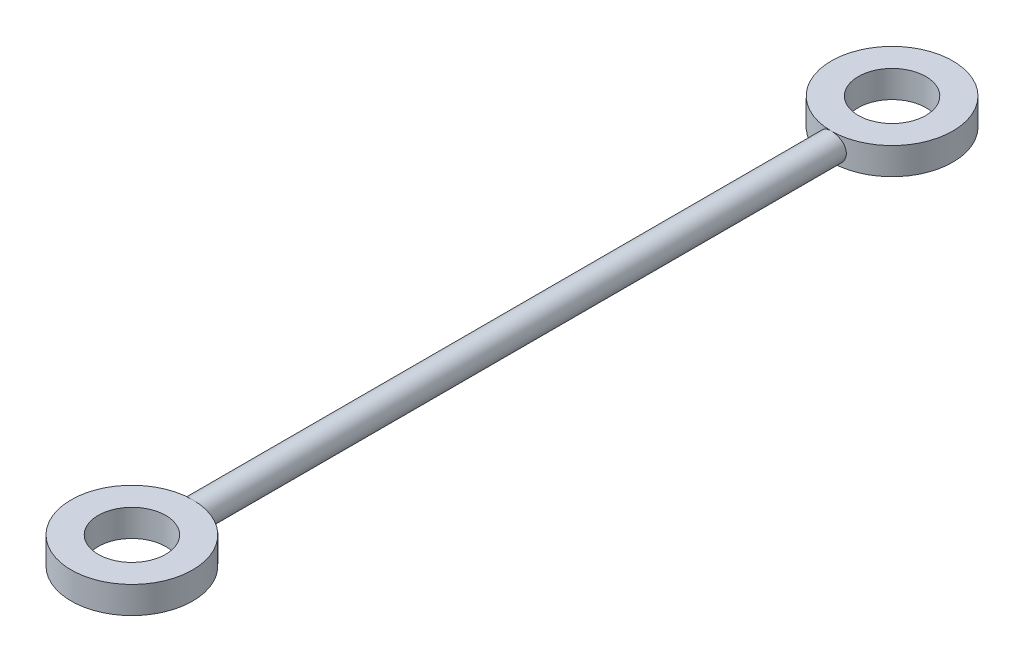
ISO-10303-21;
HEADER;
FILE_DESCRIPTION(('STEP AP214'),'2;1');
FILE_NAME('part.step','',(''),(''),'','','');
FILE_SCHEMA(('AUTOMOTIVE_DESIGN { 1 0 10303 214 1 1 1 1 }'));
ENDSEC;
DATA;
#1=APPLICATION_CONTEXT('core data for automotive mechanical design processes');
#2=APPLICATION_PROTOCOL_DEFINITION('international standard','automotive_design',2000,#1);
#3=PRODUCT_CONTEXT('',#1,'mechanical');
#4=PRODUCT('Part','Part','',(#3));
#5=PRODUCT_RELATED_PRODUCT_CATEGORY('part','',(#4));
#6=PRODUCT_DEFINITION_FORMATION('','',#4);
#7=PRODUCT_DEFINITION_CONTEXT('part definition',#1,'design');
#8=PRODUCT_DEFINITION('design','',#6,#7);
#9=PRODUCT_DEFINITION_SHAPE('','',#8);
#10=(LENGTH_UNIT() NAMED_UNIT(*) SI_UNIT(.MILLI.,.METRE.));
#11=(NAMED_UNIT(*) PLANE_ANGLE_UNIT() SI_UNIT($,.RADIAN.));
#12=(NAMED_UNIT(*) SI_UNIT($,.STERADIAN.) SOLID_ANGLE_UNIT());
#13=UNCERTAINTY_MEASURE_WITH_UNIT(LENGTH_MEASURE(1.E-05),#10,'distance_accuracy_value','');
#14=(GEOMETRIC_REPRESENTATION_CONTEXT(3) GLOBAL_UNCERTAINTY_ASSIGNED_CONTEXT((#13)) GLOBAL_UNIT_ASSIGNED_CONTEXT((#10,
#11,#12)) REPRESENTATION_CONTEXT('',''));
#15=CARTESIAN_POINT('',(0.,0.,0.));
#16=DIRECTION('',(0.,0.,1.));
#17=DIRECTION('',(1.,0.,0.));
#18=AXIS2_PLACEMENT_3D('',#15,#16,#17);
#19=CARTESIAN_POINT('',(0.,0.,493.));
#20=DIRECTION('',(0.,0.,-1.));
#21=DIRECTION('',(-1.,0.,0.));
#22=AXIS2_PLACEMENT_3D('',#19,#20,#21);
#23=CYLINDRICAL_SURFACE('',#22,10.);
#24=CARTESIAN_POINT('',(-10.,0.,484.125178063039));
#25=CARTESIAN_POINT('',(-10.0000066355174,0.277197442532807,484.125182060645));
#26=CARTESIAN_POINT('',(-9.98847171475353,0.554316796202622,484.12254640704));
#27=CARTESIAN_POINT('',(-9.94244080091867,1.10662458692624,484.112091824683));
#28=CARTESIAN_POINT('',(-9.90794144345641,1.38181273507938,484.104272136449));
#29=CARTESIAN_POINT('',(-9.81622730662358,1.92834846536891,484.083671931044));
#30=CARTESIAN_POINT('',(-9.75899865983989,2.19969359797047,484.07088838547));
#31=CARTESIAN_POINT('',(-9.6222897000386,2.73646498042402,484.040741157838));
#32=CARTESIAN_POINT('',(-9.54280889358356,3.00189109888207,484.023377374215));
#33=CARTESIAN_POINT('',(-9.36232363211918,3.52466728040577,483.984600463437));
#34=CARTESIAN_POINT('',(-9.26134411393705,3.78202630725405,483.963192030971));
#35=CARTESIAN_POINT('',(-9.03856882202602,4.28724791885802,483.916928336009));
#36=CARTESIAN_POINT('',(-8.91677289202699,4.53511043230566,483.892073047636));
#37=CARTESIAN_POINT('',(-8.65327610991877,5.01964639725508,483.839623591996));
#38=CARTESIAN_POINT('',(-8.51157928532596,5.2563220998074,483.812029979238));
#39=CARTESIAN_POINT('',(-8.20920291384275,5.71707494293494,483.75485720294));
#40=CARTESIAN_POINT('',(-8.04851710517191,5.94114789149128,483.725277385829));
#41=CARTESIAN_POINT('',(-7.70665196761771,6.37853821202931,483.664482493137));
#42=CARTESIAN_POINT('',(-7.52519346875172,6.59163489616678,483.633249171804));
#43=CARTESIAN_POINT('',(-7.14508742414899,7.00185098948534,483.570451026165));
#44=CARTESIAN_POINT('',(-6.94643973376854,7.19897026419261,483.538886199069));
#45=CARTESIAN_POINT('',(-6.533227228317,7.57596048338589,483.476291619297));
#46=CARTESIAN_POINT('',(-6.31865836807533,7.7558270175847,483.44526200509));
#47=CARTESIAN_POINT('',(-5.87514943275329,8.09696615352433,483.384613786561));
#48=CARTESIAN_POINT('',(-5.64621442322683,8.25824525299123,483.354994691295));
#49=CARTESIAN_POINT('',(-5.17281633078056,8.56283030998386,483.29765738967));
#50=CARTESIAN_POINT('',(-4.92820929930194,8.7059173191924,483.269963882132));
#51=CARTESIAN_POINT('',(-4.4274736123192,8.97093752710851,483.217628054754));
#52=CARTESIAN_POINT('',(-4.17134484741106,9.09287052489587,483.192985763894));
#53=CARTESIAN_POINT('',(-3.64939077987307,9.3146305073054,483.147457610355));
#54=CARTESIAN_POINT('',(-3.38356634803353,9.41445947147582,483.126571411326));
#55=CARTESIAN_POINT('',(-2.84411354338911,9.59122397243424,483.089153778601));
#56=CARTESIAN_POINT('',(-2.57048531244741,9.66815992509783,483.072622265799));
#57=CARTESIAN_POINT('',(-2.0219059450153,9.79744984081775,483.044620975403));
#58=CARTESIAN_POINT('',(-1.74704760529242,9.85018087432109,483.033073734313));
#59=CARTESIAN_POINT('',(-1.19371647833373,9.93243539867256,483.014984059837));
#60=CARTESIAN_POINT('',(-0.915243726257882,9.96195911510308,483.008441577804));
#61=CARTESIAN_POINT('',(-0.356758613685382,9.99755014860303,483.00054770417));
#62=CARTESIAN_POINT('',(-0.0767464148417817,10.0036198831168,482.99919577757));
#63=CARTESIAN_POINT('',(0.482775600467452,9.99225819963959,483.00172011431));
#64=CARTESIAN_POINT('',(0.762285421778734,9.97482700955647,483.005596326948));
#65=CARTESIAN_POINT('',(1.31384294910447,9.9171240024544,483.018352889529));
#66=CARTESIAN_POINT('',(1.58593543344871,9.87725932241897,483.027144022406));
#67=CARTESIAN_POINT('',(2.12572525714352,9.77531239015691,483.049424243046));
#68=CARTESIAN_POINT('',(2.39342265664285,9.71323044224934,483.062913266462));
#69=CARTESIAN_POINT('',(2.92252601527151,9.56734760197829,483.094220073175));
#70=CARTESIAN_POINT('',(3.18393292068278,9.48354999891512,483.112037200863));
#71=CARTESIAN_POINT('',(3.69881570289267,9.29483575163701,483.151527771881));
#72=CARTESIAN_POINT('',(3.95228858085104,9.18991123080244,483.173202653123));
#73=CARTESIAN_POINT('',(4.45132952902083,8.95889607614719,483.21999399981));
#74=CARTESIAN_POINT('',(4.69682645024667,8.83265662888045,483.245134416615));
#75=CARTESIAN_POINT('',(5.17634390438709,8.5604600311286,483.298057529706));
#76=CARTESIAN_POINT('',(5.41036398315088,8.41450210121898,483.325840330427));
#77=CARTESIAN_POINT('',(5.86542059030689,8.10387197900684,483.383305253708));
#78=CARTESIAN_POINT('',(6.08645582299911,7.93919792390072,483.412987565196));
#79=CARTESIAN_POINT('',(6.51409742411986,7.59225589944118,483.473455341241));
#80=CARTESIAN_POINT('',(6.72070358742227,7.40998768005382,483.50424082147));
#81=CARTESIAN_POINT('',(7.12243480841223,7.02495444933247,483.566756381913));
#82=CARTESIAN_POINT('',(7.31721740168041,6.82183293776882,483.598492538258));
#83=CARTESIAN_POINT('',(7.6890150554252,6.39985331789804,483.661364417843));
#84=CARTESIAN_POINT('',(7.8660304215152,6.18099548038201,483.692500151402));
#85=CARTESIAN_POINT('',(8.20111653213186,5.7289494722103,483.753297300597));
#86=CARTESIAN_POINT('',(8.35918269845478,5.49575785895996,483.782958358935));
#87=CARTESIAN_POINT('',(8.65513773025569,5.01675375156801,483.839935440696));
#88=CARTESIAN_POINT('',(8.79303430654859,4.77094612932034,483.867252358622));
#89=CARTESIAN_POINT('',(9.04813261249284,4.26745880992954,483.918844183761));
#90=CARTESIAN_POINT('',(9.16526331319349,4.0097420272449,483.943108570751));
#91=CARTESIAN_POINT('',(9.37735432866314,3.4850115369423,483.987763291236));
#92=CARTESIAN_POINT('',(9.47231454266676,3.21799778707574,484.008153607124));
#93=CARTESIAN_POINT('',(9.6392890067375,2.67662771181626,484.044438189063));
#94=CARTESIAN_POINT('',(9.7113063454228,2.40227238015765,484.060333060267));
#95=CARTESIAN_POINT('',(9.83181147093619,1.84820359508206,484.087139679447));
#96=CARTESIAN_POINT('',(9.88029973496401,1.56849025045205,484.098051528482));
#97=CARTESIAN_POINT('',(9.95256530014125,1.01172291908329,484.114378365281));
#98=CARTESIAN_POINT('',(9.97684100544706,0.734736783457172,484.119904165499));
#99=CARTESIAN_POINT('',(10.0022454063079,0.179651619634437,484.125687932935));
#100=CARTESIAN_POINT('',(10.0033744247638,-0.0984473929831904,484.12594597364));
#101=CARTESIAN_POINT('',(9.98247709090377,-0.65370896964737,484.121186613415));
#102=CARTESIAN_POINT('',(9.96045227188063,-0.930871594484082,484.116169561813));
#103=CARTESIAN_POINT('',(9.89343360462578,-1.4822623849427,484.10101198488));
#104=CARTESIAN_POINT('',(9.84843982491226,-1.7564905593158,484.090871474832));
#105=CARTESIAN_POINT('',(9.73654828490245,-2.29668749663247,484.065925934119));
#106=CARTESIAN_POINT('',(9.66992730038299,-2.5627163983516,484.051179928606));
#107=CARTESIAN_POINT('',(9.51516232615793,-3.08815397899649,484.017413076944));
#108=CARTESIAN_POINT('',(9.42701856456304,-3.34756272805424,483.998392276103));
#109=CARTESIAN_POINT('',(9.22988482846472,-3.85798761759896,483.956619474791));
#110=CARTESIAN_POINT('',(9.12089710368716,-4.10900466038585,483.933867877029));
#111=CARTESIAN_POINT('',(8.88281832727282,-4.6011176518281,483.88525987347));
#112=CARTESIAN_POINT('',(8.75371963051583,-4.84220978331397,483.859402287801));
#113=CARTESIAN_POINT('',(8.47421043922678,-5.31645367518366,483.804883360639));
#114=CARTESIAN_POINT('',(8.32350174323971,-5.54942542925457,483.776184902282));
#115=CARTESIAN_POINT('',(8.00329673185376,-6.00200961456149,483.717116754865));
#116=CARTESIAN_POINT('',(7.83379193643558,-6.22161594610396,483.686746314612));
#117=CARTESIAN_POINT('',(7.47717447959211,-6.64595209949791,483.625180600558));
#118=CARTESIAN_POINT('',(7.29005981359174,-6.85068022301404,483.593985233145));
#119=CARTESIAN_POINT('',(6.89956213124844,-7.24380909287628,483.531639218675));
#120=CARTESIAN_POINT('',(6.69618625448154,-7.43221692985689,483.500488558041));
#121=CARTESIAN_POINT('',(6.27024921924229,-7.79511313541661,483.438456157857));
#122=CARTESIAN_POINT('',(6.04738845010294,-7.96925304493631,483.407591884327));
#123=CARTESIAN_POINT('',(5.58764622676977,-8.29807519539926,483.347654947291));
#124=CARTESIAN_POINT('',(5.35077002981555,-8.45276466508074,483.318581620243));
#125=CARTESIAN_POINT('',(4.86449494214552,-8.74166354742357,483.263028986792));
#126=CARTESIAN_POINT('',(4.61509400819286,-8.8758696039818,483.236550105731));
#127=CARTESIAN_POINT('',(4.10553622657001,-9.1227583522989,483.186942883172));
#128=CARTESIAN_POINT('',(3.84537950997421,-9.23544130625316,483.16381450086));
#129=CARTESIAN_POINT('',(3.31788423375226,-9.43773881903109,483.121706981733));
#130=CARTESIAN_POINT('',(3.05060386047587,-9.52749960864282,483.102701665471));
#131=CARTESIAN_POINT('',(2.5091540113753,-9.68419194640782,483.069189747035));
#132=CARTESIAN_POINT('',(2.2349845506361,-9.75112354454529,483.054683135012));
#133=CARTESIAN_POINT('',(1.68179439258039,-9.8615979063935,483.030585909788));
#134=CARTESIAN_POINT('',(1.40277430900402,-9.90514360715957,483.020994679268));
#135=CARTESIAN_POINT('',(0.841923873246669,-9.9684904357305,483.007002286061));
#136=CARTESIAN_POINT('',(0.560093568443582,-9.98829196316142,483.002601036025));
#137=CARTESIAN_POINT('',(0.00179755325416161,-10.0038143518799,482.999152788285));
#138=CARTESIAN_POINT('',(-0.274653474233067,-10.000042917947,482.999992903477));
#139=CARTESIAN_POINT('',(-0.826229659015594,-9.9696355052774,483.006740368801));
#140=CARTESIAN_POINT('',(-1.10135483651436,-9.94299987606321,483.012647641473));
#141=CARTESIAN_POINT('',(-1.64830268540822,-9.86708299888812,483.029365589568));
#142=CARTESIAN_POINT('',(-1.92012543716311,-9.81780230309981,483.040176145431));
#143=CARTESIAN_POINT('',(-2.45855285100677,-9.69699148132744,483.066402646736));
#144=CARTESIAN_POINT('',(-2.7251574910218,-9.62546126124464,483.081818611656));
#145=CARTESIAN_POINT('',(-3.2503372803598,-9.46101204377771,483.116770134999));
#146=CARTESIAN_POINT('',(-3.50893806699979,-9.36817164202437,483.136290533879));
#147=CARTESIAN_POINT('',(-4.01746316200564,-9.16162286711694,483.178965587602));
#148=CARTESIAN_POINT('',(-4.2673842819051,-9.04790691979081,483.202121561079));
#149=CARTESIAN_POINT('',(-4.75676892894314,-8.80047280579502,483.251439878226));
#150=CARTESIAN_POINT('',(-4.99623372160148,-8.666757068399,483.277601856681));
#151=CARTESIAN_POINT('',(-5.46319502588091,-8.38024707534127,483.332240126449));
#152=CARTESIAN_POINT('',(-5.6906910352325,-8.22745201992299,483.360716514757));
#153=CARTESIAN_POINT('',(-6.13656537636527,-7.90066114468177,483.419801168216));
#154=CARTESIAN_POINT('',(-6.35467908683693,-7.72630973821802,483.450440195041));
#155=CARTESIAN_POINT('',(-6.77550910055343,-7.36004695131374,483.512499216879));
#156=CARTESIAN_POINT('',(-6.97822521891473,-7.16813536008375,483.543919221264));
#157=CARTESIAN_POINT('',(-7.36696631526038,-6.767986046255,483.606683032564));
#158=CARTESIAN_POINT('',(-7.55298714300411,-6.55974428815461,483.638026818658));
#159=CARTESIAN_POINT('',(-7.90702754703794,-6.12835824073688,483.699760566317));
#160=CARTESIAN_POINT('',(-8.07504750769643,-5.90521426978833,483.730150548238));
#161=CARTESIAN_POINT('',(-8.39417795554417,-5.44223601949818,483.789543065749));
#162=CARTESIAN_POINT('',(-8.54501578914354,-5.2022103737809,483.818519910858));
#163=CARTESIAN_POINT('',(-8.82583821470053,-4.71007650581806,483.873759978258));
#164=CARTESIAN_POINT('',(-8.9558304617533,-4.45797276336975,483.900024195437));
#165=CARTESIAN_POINT('',(-9.19397978092942,-3.94347878991424,483.949057555605));
#166=CARTESIAN_POINT('',(-9.3021486667316,-3.68109421661574,483.971828587958));
#167=CARTESIAN_POINT('',(-9.49586125307177,-3.14787518141745,484.013202099574));
#168=CARTESIAN_POINT('',(-9.58140894978562,-2.87704222144189,484.031805315019));
#169=CARTESIAN_POINT('',(-9.76938744890762,-2.17967135398237,484.073094877285));
#170=CARTESIAN_POINT('',(-9.85573543951876,-1.74848909006035,484.092507566439));
#171=CARTESIAN_POINT('',(-9.97103497070132,-0.878138996188523,484.118545661969));
#172=CARTESIAN_POINT('',(-9.99998949195373,-0.438971582136196,484.125171732406));
#173=CARTESIAN_POINT('',(-10.,0.,484.125178063039));
#174=B_SPLINE_CURVE_WITH_KNOTS('',3,(#24,#25,#26,#27,#28,#29,#30,#31,#32,#33,#34,#35,#36,#37,
#38,#39,#40,#41,#42,#43,#44,#45,#46,#47,#48,#49,#50,#51,#52,#53,#54,#55,#56,#57,#58,#59,#60,#61,
#62,#63,#64,#65,#66,#67,#68,#69,#70,#71,#72,#73,#74,#75,#76,#77,#78,#79,#80,#81,#82,#83,#84,#85,
#86,#87,#88,#89,#90,#91,#92,#93,#94,#95,#96,#97,#98,#99,#100,#101,#102,#103,#104,#105,#106,#107,
#108,#109,#110,#111,#112,#113,#114,#115,#116,#117,#118,#119,#120,#121,#122,#123,#124,#125,#126,
#127,#128,#129,#130,#131,#132,#133,#134,#135,#136,#137,#138,#139,#140,#141,#142,#143,#144,#145,
#146,#147,#148,#149,#150,#151,#152,#153,#154,#155,#156,#157,#158,#159,#160,#161,#162,#163,#164,
#165,#166,#167,#168,#169,#170,#171,#172,#173),.UNSPECIFIED.,.T.,.F.,(4,2,2,2,2,2,2,2,2,2,2,2,2,
2,2,2,2,2,2,2,2,2,2,2,2,2,2,2,2,2,2,2,2,2,2,2,2,2,2,2,2,2,2,2,2,2,2,2,2,2,2,2,2,2,2,2,2,2,2,2,2,
2,2,2,2,2,2,2,2,2,2,2,2,2,4),(0.,0.831205676531437,1.6625331551697,2.49436861778412,
3.32622252765402,4.15711675820889,4.9880172266141,5.81874978015648,6.64975704334213,
7.49365162594608,8.3375533104498,9.18167014830853,10.0254910021185,10.8786616357507,
11.7318403723304,12.584942670726,13.4380294706759,14.2773335932149,15.1166295573542,
15.9558390114323,16.7950403270612,17.6194809143563,18.4439102093818,19.2682146998802,
20.0928270817181,20.9234546086684,21.754114977952,22.5848580948334,23.4156130192982,
24.2642339450799,25.112840271264,25.9616512127427,26.8101368016697,27.66147084824,
28.5128087640683,29.3640320225156,30.2152380163456,31.0485364998869,31.8818233587396,
32.7150550391679,33.5482842340159,34.3712448056457,35.1941966554467,36.0170597326723,
36.8402363854004,37.6761192557802,38.5123807880236,39.348737629389,40.1847292589989,
41.0372340215198,41.8894210090214,42.7417474734854,43.5940635542083,44.4407982600892,
45.2875311120447,46.1341575971965,46.9807698330103,47.8092118418964,48.6376411867061,
49.4660503323384,50.2944629815653,51.1198680458264,51.9455731817979,52.771178104857,
53.5968176468029,54.4385718995447,55.2803362578868,56.1223092920759,56.9642643442224,
57.8181230778923,58.671667528595,59.5247486814391,60.3776790312803,61.6940498410606,
63.0103522844513),.UNSPECIFIED.);
#175=CARTESIAN_POINT('',(0.,-10.,483.));
#176=VERTEX_POINT('',#175);
#177=CARTESIAN_POINT('',(0.,10.,483.));
#178=VERTEX_POINT('',#177);
#179=EDGE_CURVE('E69',#176,#178,#174,.T.);
#180=ORIENTED_EDGE('',*,*,#179,.T.);
#181=EDGE_CURVE('E67',#178,#176,#174,.T.);
#182=ORIENTED_EDGE('',*,*,#181,.T.);
#183=EDGE_LOOP('',(#180,#182));
#184=FACE_BOUND('',#183,.T.);
#185=CARTESIAN_POINT('',(-10.,0.,8.87482193696059));
#186=CARTESIAN_POINT('',(-10.0000066355174,0.277197442532807,8.87481793935492));
#187=CARTESIAN_POINT('',(-9.98847171475353,0.554316796202622,8.87745359296051));
#188=CARTESIAN_POINT('',(-9.94244080091867,1.10662458692624,8.88790817531715));
#189=CARTESIAN_POINT('',(-9.90794144345641,1.38181273507938,8.89572786355144));
#190=CARTESIAN_POINT('',(-9.81622730662358,1.92834846536891,8.91632806895643));
#191=CARTESIAN_POINT('',(-9.75899865983989,2.19969359797046,8.92911161452978));
#192=CARTESIAN_POINT('',(-9.6222897000386,2.73646498042402,8.95925884216154));
#193=CARTESIAN_POINT('',(-9.54280889358356,3.00189109888207,8.97662262578536));
#194=CARTESIAN_POINT('',(-9.36232363211918,3.52466728040577,9.01539953656343));
#195=CARTESIAN_POINT('',(-9.26134411393705,3.78202630725405,9.03680796902857));
#196=CARTESIAN_POINT('',(-9.03856882202602,4.28724791885802,9.0830716639913));
#197=CARTESIAN_POINT('',(-8.91677289202699,4.53511043230566,9.10792695236439));
#198=CARTESIAN_POINT('',(-8.65327610991877,5.01964639725509,9.16037640800452));
#199=CARTESIAN_POINT('',(-8.51157928532595,5.2563220998074,9.18797002076242));
#200=CARTESIAN_POINT('',(-8.20920291384274,5.71707494293494,9.2451427970597));
#201=CARTESIAN_POINT('',(-8.04851710517191,5.94114789149128,9.27472261417078));
#202=CARTESIAN_POINT('',(-7.70665196761771,6.3785382120293,9.33551750686349));
#203=CARTESIAN_POINT('',(-7.52519346875172,6.59163489616677,9.3667508281955));
#204=CARTESIAN_POINT('',(-7.14508742414899,7.00185098948534,9.42954897383532));
#205=CARTESIAN_POINT('',(-6.94643973376854,7.19897026419261,9.46111380093072));
#206=CARTESIAN_POINT('',(-6.533227228317,7.57596048338589,9.52370838070293));
#207=CARTESIAN_POINT('',(-6.31865836807533,7.7558270175847,9.55473799491041));
#208=CARTESIAN_POINT('',(-5.87514943275329,8.09696615352433,9.61538621343851));
#209=CARTESIAN_POINT('',(-5.64621442322683,8.25824525299123,9.64500530870539));
#210=CARTESIAN_POINT('',(-5.17281633078056,8.56283030998386,9.70234261033026));
#211=CARTESIAN_POINT('',(-4.92820929930194,8.7059173191924,9.73003611786768));
#212=CARTESIAN_POINT('',(-4.42747361231919,8.97093752710852,9.78237194524591));
#213=CARTESIAN_POINT('',(-4.17134484741105,9.09287052489587,9.80701423610572));
#214=CARTESIAN_POINT('',(-3.64939077987306,9.3146305073054,9.85254238964527));
#215=CARTESIAN_POINT('',(-3.38356634803352,9.41445947147582,9.87342858867398));
#216=CARTESIAN_POINT('',(-2.84411354338911,9.59122397243423,9.91084622139857));
#217=CARTESIAN_POINT('',(-2.57048531244741,9.66815992509783,9.92737773420128));
#218=CARTESIAN_POINT('',(-2.0219059450153,9.79744984081775,9.95537902459655));
#219=CARTESIAN_POINT('',(-1.74704760529242,9.85018087432109,9.96692626568725));
#220=CARTESIAN_POINT('',(-1.19371647833373,9.93243539867256,9.9850159401631));
#221=CARTESIAN_POINT('',(-0.915243726257882,9.96195911510308,9.99155842219606));
#222=CARTESIAN_POINT('',(-0.356758613685381,9.99755014860303,9.99945229582951));
#223=CARTESIAN_POINT('',(-0.0767464148417808,10.0036198831168,10.0008042224299));
#224=CARTESIAN_POINT('',(0.482775600467452,9.99225819963959,9.99827988569021));
#225=CARTESIAN_POINT('',(0.762285421778733,9.97482700955647,9.9944036730518));
#226=CARTESIAN_POINT('',(1.31384294910447,9.9171240024544,9.98164711047053));
#227=CARTESIAN_POINT('',(1.5859354334487,9.87725932241898,9.97285597759435));
#228=CARTESIAN_POINT('',(2.12572525714351,9.77531239015692,9.95057575695372));
#229=CARTESIAN_POINT('',(2.39342265664284,9.71323044224934,9.93708673353827));
#230=CARTESIAN_POINT('',(2.9225260152715,9.56734760197829,9.90577992682529));
#231=CARTESIAN_POINT('',(3.18393292068278,9.48354999891512,9.88796279913726));
#232=CARTESIAN_POINT('',(3.69881570289267,9.29483575163702,9.84847222811891));
#233=CARTESIAN_POINT('',(3.95228858085104,9.18991123080245,9.82679734687676));
#234=CARTESIAN_POINT('',(4.45132952902083,8.95889607614719,9.78000600018973));
#235=CARTESIAN_POINT('',(4.69682645024667,8.83265662888045,9.75486558338522));
#236=CARTESIAN_POINT('',(5.17634390438709,8.5604600311286,9.70194247029399));
#237=CARTESIAN_POINT('',(5.41036398315087,8.41450210121898,9.674159669573));
#238=CARTESIAN_POINT('',(5.86542059030688,8.10387197900684,9.61669474629211));
#239=CARTESIAN_POINT('',(6.08645582299911,7.93919792390072,9.58701243480384));
#240=CARTESIAN_POINT('',(6.51409742411986,7.59225589944118,9.52654465875931));
#241=CARTESIAN_POINT('',(6.72070358742227,7.40998768005382,9.49575917852962));
#242=CARTESIAN_POINT('',(7.12243480841223,7.02495444933247,9.43324361808737));
#243=CARTESIAN_POINT('',(7.3172174016804,6.82183293776882,9.40150746174175));
#244=CARTESIAN_POINT('',(7.6890150554252,6.39985331789804,9.33863558215709));
#245=CARTESIAN_POINT('',(7.8660304215152,6.18099548038201,9.30749984859763));
#246=CARTESIAN_POINT('',(8.20111653213187,5.7289494722103,9.24670269940313));
#247=CARTESIAN_POINT('',(8.35918269845478,5.49575785895996,9.21704164106466));
#248=CARTESIAN_POINT('',(8.65513773025569,5.01675375156801,9.16006455930372));
#249=CARTESIAN_POINT('',(8.79303430654859,4.77094612932033,9.13274764137807));
#250=CARTESIAN_POINT('',(9.04813261249284,4.26745880992953,9.08115581623868));
#251=CARTESIAN_POINT('',(9.16526331319349,4.0097420272449,9.05689142924942));
#252=CARTESIAN_POINT('',(9.37735432866314,3.4850115369423,9.01223670876439));
#253=CARTESIAN_POINT('',(9.47231454266676,3.21799778707574,8.99184639287644));
#254=CARTESIAN_POINT('',(9.63928900673751,2.67662771181626,8.95556181093747));
#255=CARTESIAN_POINT('',(9.7113063454228,2.40227238015765,8.93966693973259));
#256=CARTESIAN_POINT('',(9.83181147093619,1.84820359508206,8.9128603205535));
#257=CARTESIAN_POINT('',(9.88029973496401,1.56849025045205,8.9019484715175));
#258=CARTESIAN_POINT('',(9.95256530014125,1.0117229190833,8.88562163471921));
#259=CARTESIAN_POINT('',(9.97684100544706,0.734736783457178,8.88009583450122));
#260=CARTESIAN_POINT('',(10.0022454063079,0.179651619634443,8.87431206706492));
#261=CARTESIAN_POINT('',(10.0033744247638,-0.0984473929831842,8.87405402636031));
#262=CARTESIAN_POINT('',(9.98247709090377,-0.653708969647364,8.8788133865848));
#263=CARTESIAN_POINT('',(9.96045227188063,-0.930871594484075,8.88383043818687));
#264=CARTESIAN_POINT('',(9.89343360462578,-1.48226238494269,8.89898801512035));
#265=CARTESIAN_POINT('',(9.84843982491226,-1.75649055931579,8.90912852516807));
#266=CARTESIAN_POINT('',(9.73654828490245,-2.29668749663247,8.93407406588102));
#267=CARTESIAN_POINT('',(9.66992730038299,-2.56271639835159,8.94882007139435));
#268=CARTESIAN_POINT('',(9.51516232615793,-3.08815397899648,8.98258692305569));
#269=CARTESIAN_POINT('',(9.42701856456304,-3.34756272805423,9.0016077238968));
#270=CARTESIAN_POINT('',(9.22988482846472,-3.85798761759896,9.04338052520908));
#271=CARTESIAN_POINT('',(9.12089710368716,-4.10900466038584,9.06613212297099));
#272=CARTESIAN_POINT('',(8.88281832727281,-4.6011176518281,9.11474012653005));
#273=CARTESIAN_POINT('',(8.75371963051583,-4.84220978331397,9.14059771219907));
#274=CARTESIAN_POINT('',(8.47421043922679,-5.31645367518365,9.19511663936103));
#275=CARTESIAN_POINT('',(8.32350174323972,-5.54942542925456,9.22381509771803));
#276=CARTESIAN_POINT('',(8.00329673185377,-6.00200961456148,9.28288324513542));
#277=CARTESIAN_POINT('',(7.83379193643559,-6.22161594610395,9.31325368538775));
#278=CARTESIAN_POINT('',(7.47717447959211,-6.6459520994979,9.37481939944172));
#279=CARTESIAN_POINT('',(7.29005981359175,-6.85068022301403,9.40601476685552));
#280=CARTESIAN_POINT('',(6.89956213124844,-7.24380909287627,9.46836078132453));
#281=CARTESIAN_POINT('',(6.69618625448154,-7.43221692985688,9.49951144195942));
#282=CARTESIAN_POINT('',(6.2702492192423,-7.79511313541661,9.56154384214284));
#283=CARTESIAN_POINT('',(6.04738845010294,-7.96925304493631,9.5924081156732));
#284=CARTESIAN_POINT('',(5.58764622676977,-8.29807519539926,9.65234505270932));
#285=CARTESIAN_POINT('',(5.35077002981555,-8.45276466508074,9.68141837975739));
#286=CARTESIAN_POINT('',(4.86449494214552,-8.74166354742357,9.73697101320777));
#287=CARTESIAN_POINT('',(4.61509400819287,-8.8758696039818,9.76344989426939));
#288=CARTESIAN_POINT('',(4.10553622657002,-9.1227583522989,9.81305711682771));
#289=CARTESIAN_POINT('',(3.84537950997422,-9.23544130625316,9.83618549913951));
#290=CARTESIAN_POINT('',(3.31788423375227,-9.43773881903109,9.87829301826706));
#291=CARTESIAN_POINT('',(3.05060386047588,-9.52749960864281,9.89729833452916));
#292=CARTESIAN_POINT('',(2.50915401137532,-9.68419194640782,9.93081025296465));
#293=CARTESIAN_POINT('',(2.23498455063611,-9.75112354454529,9.94531686498788));
#294=CARTESIAN_POINT('',(1.6817943925804,-9.8615979063935,9.96941409021155));
#295=CARTESIAN_POINT('',(1.40277430900404,-9.90514360715956,9.97900532073213));
#296=CARTESIAN_POINT('',(0.841923873246683,-9.9684904357305,9.99299771393914));
#297=CARTESIAN_POINT('',(0.560093568443596,-9.98829196316142,9.99739896397546));
#298=CARTESIAN_POINT('',(0.00179755325417608,-10.0038143518799,10.0008472117148));
#299=CARTESIAN_POINT('',(-0.274653474233052,-10.000042917947,10.0000070965235));
#300=CARTESIAN_POINT('',(-0.82622965901558,-9.9696355052774,9.99325963119902));
#301=CARTESIAN_POINT('',(-1.10135483651435,-9.94299987606322,9.98735235852702));
#302=CARTESIAN_POINT('',(-1.64830268540821,-9.86708299888812,9.97063441043166));
#303=CARTESIAN_POINT('',(-1.92012543716309,-9.81780230309982,9.95982385456902));
#304=CARTESIAN_POINT('',(-2.45855285100676,-9.69699148132744,9.93359735326387));
#305=CARTESIAN_POINT('',(-2.72515749102179,-9.62546126124464,9.91818138834394));
#306=CARTESIAN_POINT('',(-3.25033728035979,-9.46101204377772,9.88322986500108));
#307=CARTESIAN_POINT('',(-3.50893806699978,-9.36817164202438,9.8637094661207));
#308=CARTESIAN_POINT('',(-4.01746316200562,-9.16162286711695,9.82103441239795));
#309=CARTESIAN_POINT('',(-4.26738428190508,-9.04790691979082,9.79787843892067));
#310=CARTESIAN_POINT('',(-4.75676892894312,-8.80047280579504,9.74856012177415));
#311=CARTESIAN_POINT('',(-4.99623372160146,-8.66675706839902,9.72239814331851));
#312=CARTESIAN_POINT('',(-5.46319502588089,-8.38024707534129,9.66775987355106));
#313=CARTESIAN_POINT('',(-5.69069103523249,-8.227452019923,9.63928348524255));
#314=CARTESIAN_POINT('',(-6.13656537636526,-7.90066114468177,9.58019883178431));
#315=CARTESIAN_POINT('',(-6.35467908683693,-7.72630973821802,9.54955980495921));
#316=CARTESIAN_POINT('',(-6.77550910055342,-7.36004695131375,9.48750078312063));
#317=CARTESIAN_POINT('',(-6.97822521891472,-7.16813536008376,9.45608077873573));
#318=CARTESIAN_POINT('',(-7.36696631526037,-6.76798604625501,9.39331696743619));
#319=CARTESIAN_POINT('',(-7.5529871430041,-6.55974428815462,9.36197318134208));
#320=CARTESIAN_POINT('',(-7.90702754703793,-6.12835824073689,9.30023943368347));
#321=CARTESIAN_POINT('',(-8.07504750769642,-5.90521426978834,9.2698494517624));
#322=CARTESIAN_POINT('',(-8.39417795554417,-5.4422360194982,9.21045693425104));
#323=CARTESIAN_POINT('',(-8.54501578914353,-5.20221037378092,9.18148008914194));
#324=CARTESIAN_POINT('',(-8.82583821470053,-4.71007650581808,9.12624002174161));
#325=CARTESIAN_POINT('',(-8.9558304617533,-4.45797276336976,9.09997580456285));
#326=CARTESIAN_POINT('',(-9.19397978092942,-3.94347878991425,9.05094244439463));
#327=CARTESIAN_POINT('',(-9.30214866673159,-3.68109421661575,9.02817141204182));
#328=CARTESIAN_POINT('',(-9.49586125307176,-3.14787518141746,8.98679790042632));
#329=CARTESIAN_POINT('',(-9.58140894978561,-2.87704222144191,8.96819468498128));
#330=CARTESIAN_POINT('',(-9.76938744890761,-2.17967135398238,8.92690512271501));
#331=CARTESIAN_POINT('',(-9.85573543951876,-1.74848909006036,8.90749243356082));
#332=CARTESIAN_POINT('',(-9.97103497070132,-0.878138996188528,8.88145433803097));
#333=CARTESIAN_POINT('',(-9.99998949195373,-0.438971582136198,8.87482826759362));
#334=CARTESIAN_POINT('',(-10.,0.,8.87482193696059));
#335=B_SPLINE_CURVE_WITH_KNOTS('',3,(#185,#186,#187,#188,#189,#190,#191,#192,#193,#194,#195,
#196,#197,#198,#199,#200,#201,#202,#203,#204,#205,#206,#207,#208,#209,#210,#211,#212,#213,#214,
#215,#216,#217,#218,#219,#220,#221,#222,#223,#224,#225,#226,#227,#228,#229,#230,#231,#232,#233,
#234,#235,#236,#237,#238,#239,#240,#241,#242,#243,#244,#245,#246,#247,#248,#249,#250,#251,#252,
#253,#254,#255,#256,#257,#258,#259,#260,#261,#262,#263,#264,#265,#266,#267,#268,#269,#270,#271,
#272,#273,#274,#275,#276,#277,#278,#279,#280,#281,#282,#283,#284,#285,#286,#287,#288,#289,#290,
#291,#292,#293,#294,#295,#296,#297,#298,#299,#300,#301,#302,#303,#304,#305,#306,#307,#308,#309,
#310,#311,#312,#313,#314,#315,#316,#317,#318,#319,#320,#321,#322,#323,#324,#325,#326,#327,#328,
#329,#330,#331,#332,#333,#334),.UNSPECIFIED.,.T.,.F.,(4,2,2,2,2,2,2,2,2,2,2,2,2,2,2,2,2,2,2,2,2,
2,2,2,2,2,2,2,2,2,2,2,2,2,2,2,2,2,2,2,2,2,2,2,2,2,2,2,2,2,2,2,2,2,2,2,2,2,2,2,2,2,2,2,2,2,2,2,2,
2,2,2,2,2,4),(0.,0.831205676531438,1.6625331551697,2.49436861778412,3.32622252765402,
4.15711675820889,4.98801722661411,5.81874978015649,6.64975704334213,7.49365162594607,
8.33755331044981,9.18167014830854,10.0254910021185,10.8786616357507,11.7318403723305,
12.584942670726,13.4380294706759,14.2773335932149,15.1166295573542,15.9558390114323,
16.7950403270612,17.6194809143563,18.4439102093818,19.2682146998802,20.0928270817181,
20.9234546086684,21.754114977952,22.5848580948335,23.4156130192982,24.2642339450799,
25.1128402712641,25.9616512127427,26.8101368016697,27.66147084824,28.5128087640683,
29.3640320225157,30.2152380163456,31.0485364998869,31.8818233587397,32.7150550391679,
33.5482842340159,34.3712448056457,35.1941966554467,36.0170597326723,36.8402363854004,
37.6761192557802,38.5123807880236,39.348737629389,40.1847292589989,41.0372340215198,
41.8894210090214,42.7417474734854,43.5940635542083,44.4407982600892,45.2875311120446,
46.1341575971965,46.9807698330103,47.8092118418964,48.6376411867061,49.4660503323384,
50.2944629815653,51.1198680458263,51.9455731817979,52.7711781048569,53.5968176468028,
54.4385718995446,55.2803362578868,56.1223092920759,56.9642643442224,57.8181230778923,
58.671667528595,59.5247486814391,60.3776790312803,61.6940498410606,63.0103522844513),.UNSPECIFIED.);
#336=CARTESIAN_POINT('',(0.,10.,10.));
#337=VERTEX_POINT('',#336);
#338=CARTESIAN_POINT('',(0.,-10.,10.));
#339=VERTEX_POINT('',#338);
#340=EDGE_CURVE('E11',#337,#339,#335,.T.);
#341=ORIENTED_EDGE('',*,*,#340,.F.);
#342=EDGE_CURVE('E37',#339,#337,#335,.T.);
#343=ORIENTED_EDGE('',*,*,#342,.F.);
#344=EDGE_LOOP('',(#341,#343));
#345=FACE_BOUND('',#344,.T.);
#346=ADVANCED_FACE('F33',(#184,#345),#23,.T.);
#347=CARTESIAN_POINT('',(0.,0.,528.));
#348=DIRECTION('',(0.,-1.,0.));
#349=DIRECTION('',(0.,0.,-1.));
#350=AXIS2_PLACEMENT_3D('',#347,#348,#349);
#351=CYLINDRICAL_SURFACE('',#350,45.);
#352=ORIENTED_EDGE('',*,*,#181,.F.);
#353=CARTESIAN_POINT('',(0.,10.,528.));
#354=DIRECTION('',(0.,-1.,0.));
#355=DIRECTION('',(0.,0.,-1.));
#356=AXIS2_PLACEMENT_3D('',#353,#354,#355);
#357=CIRCLE('',#356,45.);
#358=EDGE_CURVE('E54',#178,#178,#357,.T.);
#359=ORIENTED_EDGE('',*,*,#358,.T.);
#360=ORIENTED_EDGE('',*,*,#179,.F.);
#361=CARTESIAN_POINT('',(0.,-10.,528.));
#362=DIRECTION('',(0.,-1.,0.));
#363=DIRECTION('',(0.,0.,-1.));
#364=AXIS2_PLACEMENT_3D('',#361,#362,#363);
#365=CIRCLE('',#364,45.);
#366=EDGE_CURVE('E101',#176,#176,#365,.T.);
#367=ORIENTED_EDGE('',*,*,#366,.F.);
#368=EDGE_LOOP('',(#352,#359,#360,#367));
#369=FACE_BOUND('',#368,.T.);
#370=ADVANCED_FACE('F79',(#369),#351,.T.);
#371=CARTESIAN_POINT('',(0.,0.,528.));
#372=DIRECTION('',(0.,-1.,0.));
#373=DIRECTION('',(0.,0.,-1.));
#374=AXIS2_PLACEMENT_3D('',#371,#372,#373);
#375=CYLINDRICAL_SURFACE('',#374,25.);
#376=CARTESIAN_POINT('',(0.,-10.,528.));
#377=DIRECTION('',(0.,-1.,0.));
#378=DIRECTION('',(0.,0.,-1.));
#379=AXIS2_PLACEMENT_3D('',#376,#377,#378);
#380=CIRCLE('',#379,25.);
#381=CARTESIAN_POINT('',(0.,-10.,503.));
#382=VERTEX_POINT('',#381);
#383=EDGE_CURVE('E73',#382,#382,#380,.T.);
#384=ORIENTED_EDGE('',*,*,#383,.T.);
#385=EDGE_LOOP('',(#384));
#386=FACE_BOUND('',#385,.T.);
#387=CARTESIAN_POINT('',(0.,10.,528.));
#388=DIRECTION('',(0.,-1.,0.));
#389=DIRECTION('',(0.,0.,-1.));
#390=AXIS2_PLACEMENT_3D('',#387,#388,#389);
#391=CIRCLE('',#390,25.);
#392=CARTESIAN_POINT('',(0.,10.,503.));
#393=VERTEX_POINT('',#392);
#394=EDGE_CURVE('E103',#393,#393,#391,.T.);
#395=ORIENTED_EDGE('',*,*,#394,.F.);
#396=EDGE_LOOP('',(#395));
#397=FACE_BOUND('',#396,.T.);
#398=ADVANCED_FACE('F84',(#386,#397),#375,.F.);
#399=CARTESIAN_POINT('',(0.,-10.,483.));
#400=DIRECTION('',(0.,-1.,0.));
#401=DIRECTION('',(0.,0.,-1.));
#402=AXIS2_PLACEMENT_3D('',#399,#400,#401);
#403=PLANE('',#402);
#404=ORIENTED_EDGE('',*,*,#366,.T.);
#405=EDGE_LOOP('',(#404));
#406=FACE_BOUND('',#405,.T.);
#407=ORIENTED_EDGE('',*,*,#383,.F.);
#408=EDGE_LOOP('',(#407));
#409=FACE_BOUND('',#408,.T.);
#410=ADVANCED_FACE('F87',(#406,#409),#403,.T.);
#411=CARTESIAN_POINT('',(0.,10.,483.));
#412=DIRECTION('',(0.,1.,0.));
#413=DIRECTION('',(0.,0.,1.));
#414=AXIS2_PLACEMENT_3D('',#411,#412,#413);
#415=PLANE('',#414);
#416=ORIENTED_EDGE('',*,*,#358,.F.);
#417=EDGE_LOOP('',(#416));
#418=FACE_BOUND('',#417,.T.);
#419=ORIENTED_EDGE('',*,*,#394,.T.);
#420=EDGE_LOOP('',(#419));
#421=FACE_BOUND('',#420,.T.);
#422=ADVANCED_FACE('F86',(#418,#421),#415,.T.);
#423=CARTESIAN_POINT('',(0.,0.,-35.));
#424=DIRECTION('',(0.,-1.,0.));
#425=DIRECTION('',(0.,0.,-1.));
#426=AXIS2_PLACEMENT_3D('',#423,#424,#425);
#427=CYLINDRICAL_SURFACE('',#426,45.);
#428=CARTESIAN_POINT('',(0.,10.,-35.));
#429=DIRECTION('',(0.,-1.,0.));
#430=DIRECTION('',(0.,0.,-1.));
#431=AXIS2_PLACEMENT_3D('',#428,#429,#430);
#432=CIRCLE('',#431,45.);
#433=EDGE_CURVE('E65',#337,#337,#432,.T.);
#434=ORIENTED_EDGE('',*,*,#433,.T.);
#435=ORIENTED_EDGE('',*,*,#340,.T.);
#436=CARTESIAN_POINT('',(0.,-10.,-35.));
#437=DIRECTION('',(0.,-1.,0.));
#438=DIRECTION('',(0.,0.,-1.));
#439=AXIS2_PLACEMENT_3D('',#436,#437,#438);
#440=CIRCLE('',#439,45.);
#441=EDGE_CURVE('E66',#339,#339,#440,.T.);
#442=ORIENTED_EDGE('',*,*,#441,.F.);
#443=ORIENTED_EDGE('',*,*,#342,.T.);
#444=EDGE_LOOP('',(#434,#435,#442,#443));
#445=FACE_BOUND('',#444,.T.);
#446=ADVANCED_FACE('F63',(#445),#427,.T.);
#447=CARTESIAN_POINT('',(0.,10.,-10.));
#448=DIRECTION('',(0.,-1.,0.));
#449=DIRECTION('',(0.,0.,-1.));
#450=AXIS2_PLACEMENT_3D('',#447,#448,#449);
#451=PLANE('',#450);
#452=ORIENTED_EDGE('',*,*,#433,.F.);
#453=EDGE_LOOP('',(#452));
#454=FACE_BOUND('',#453,.T.);
#455=CARTESIAN_POINT('',(0.,10.,-35.));
#456=DIRECTION('',(0.,-1.,0.));
#457=DIRECTION('',(0.,0.,-1.));
#458=AXIS2_PLACEMENT_3D('',#455,#456,#457);
#459=CIRCLE('',#458,25.);
#460=CARTESIAN_POINT('',(0.,10.,-60.));
#461=VERTEX_POINT('',#460);
#462=EDGE_CURVE('E109',#461,#461,#459,.T.);
#463=ORIENTED_EDGE('',*,*,#462,.T.);
#464=EDGE_LOOP('',(#463));
#465=FACE_BOUND('',#464,.T.);
#466=ADVANCED_FACE('F124',(#454,#465),#451,.F.);
#467=CARTESIAN_POINT('',(0.,0.,-35.));
#468=DIRECTION('',(0.,-1.,0.));
#469=DIRECTION('',(0.,0.,-1.));
#470=AXIS2_PLACEMENT_3D('',#467,#468,#469);
#471=CYLINDRICAL_SURFACE('',#470,25.);
#472=ORIENTED_EDGE('',*,*,#462,.F.);
#473=EDGE_LOOP('',(#472));
#474=FACE_BOUND('',#473,.T.);
#475=CARTESIAN_POINT('',(0.,-10.,-35.));
#476=DIRECTION('',(0.,-1.,0.));
#477=DIRECTION('',(0.,0.,-1.));
#478=AXIS2_PLACEMENT_3D('',#475,#476,#477);
#479=CIRCLE('',#478,25.);
#480=CARTESIAN_POINT('',(0.,-10.,-60.));
#481=VERTEX_POINT('',#480);
#482=EDGE_CURVE('E112',#481,#481,#479,.T.);
#483=ORIENTED_EDGE('',*,*,#482,.T.);
#484=EDGE_LOOP('',(#483));
#485=FACE_BOUND('',#484,.T.);
#486=ADVANCED_FACE('F118',(#474,#485),#471,.F.);
#487=CARTESIAN_POINT('',(0.,-10.,-10.));
#488=DIRECTION('',(0.,1.,0.));
#489=DIRECTION('',(0.,0.,1.));
#490=AXIS2_PLACEMENT_3D('',#487,#488,#489);
#491=PLANE('',#490);
#492=ORIENTED_EDGE('',*,*,#482,.F.);
#493=EDGE_LOOP('',(#492));
#494=FACE_BOUND('',#493,.T.);
#495=ORIENTED_EDGE('',*,*,#441,.T.);
#496=EDGE_LOOP('',(#495));
#497=FACE_BOUND('',#496,.T.);
#498=ADVANCED_FACE('F116',(#494,#497),#491,.F.);
#499=CLOSED_SHELL('',(#346,#370,#398,#410,#422,#446,#466,#486,#498));
#500=MANIFOLD_SOLID_BREP('B2',#499);
#501=ADVANCED_BREP_SHAPE_REPRESENTATION('',(#18,#500),#14);
#502=SHAPE_DEFINITION_REPRESENTATION(#9,#501);
ENDSEC;
END-ISO-10303-21;
